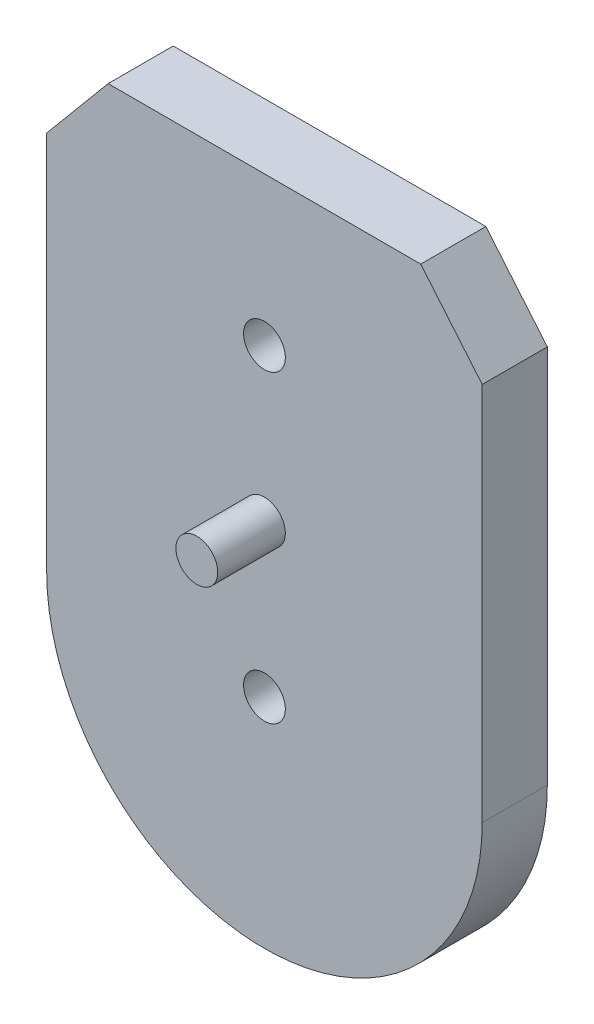
ISO-10303-21;
HEADER;
FILE_DESCRIPTION(('STEP AP214'),'2;1');
FILE_NAME('part.step','',(''),(''),'','','');
FILE_SCHEMA(('AUTOMOTIVE_DESIGN { 1 0 10303 214 1 1 1 1 }'));
ENDSEC;
DATA;
#1=APPLICATION_CONTEXT('core data for automotive mechanical design processes');
#2=APPLICATION_PROTOCOL_DEFINITION('international standard','automotive_design',2000,#1);
#3=PRODUCT_CONTEXT('',#1,'mechanical');
#4=PRODUCT('Part','Part','',(#3));
#5=PRODUCT_RELATED_PRODUCT_CATEGORY('part','',(#4));
#6=PRODUCT_DEFINITION_FORMATION('','',#4);
#7=PRODUCT_DEFINITION_CONTEXT('part definition',#1,'design');
#8=PRODUCT_DEFINITION('design','',#6,#7);
#9=PRODUCT_DEFINITION_SHAPE('','',#8);
#10=(LENGTH_UNIT() NAMED_UNIT(*) SI_UNIT(.MILLI.,.METRE.));
#11=(NAMED_UNIT(*) PLANE_ANGLE_UNIT() SI_UNIT($,.RADIAN.));
#12=(NAMED_UNIT(*) SI_UNIT($,.STERADIAN.) SOLID_ANGLE_UNIT());
#13=UNCERTAINTY_MEASURE_WITH_UNIT(LENGTH_MEASURE(1.E-05),#10,'distance_accuracy_value','');
#14=(GEOMETRIC_REPRESENTATION_CONTEXT(3) GLOBAL_UNCERTAINTY_ASSIGNED_CONTEXT((#13)) GLOBAL_UNIT_ASSIGNED_CONTEXT((#10,
#11,#12)) REPRESENTATION_CONTEXT('',''));
#15=CARTESIAN_POINT('',(0.,0.,0.));
#16=DIRECTION('',(0.,0.,1.));
#17=DIRECTION('',(1.,0.,0.));
#18=AXIS2_PLACEMENT_3D('',#15,#16,#17);
#19=CARTESIAN_POINT('',(-125.,0.,18.6875));
#20=DIRECTION('',(1.,0.,0.));
#21=DIRECTION('',(0.,0.,-1.));
#22=AXIS2_PLACEMENT_3D('',#19,#20,#21);
#23=PLANE('',#22);
#24=DIRECTION('',(0.,-1.,0.));
#25=VECTOR('',#24,1.);
#26=CARTESIAN_POINT('',(-125.,0.,-18.6875));
#27=LINE('',#26,#25);
#28=CARTESIAN_POINT('',(-125.,80.4995315023905,-18.6875));
#29=VERTEX_POINT('',#28);
#30=CARTESIAN_POINT('',(-125.,-137.375,-18.6875));
#31=VERTEX_POINT('',#30);
#32=EDGE_CURVE('E144',#29,#31,#27,.T.);
#33=ORIENTED_EDGE('',*,*,#32,.T.);
#34=DIRECTION('',(0.,0.,-1.));
#35=VECTOR('',#34,1.);
#36=CARTESIAN_POINT('',(-125.,-137.375,18.6875));
#37=LINE('',#36,#35);
#38=CARTESIAN_POINT('',(-125.,-137.375,18.6875));
#39=VERTEX_POINT('',#38);
#40=EDGE_CURVE('E11',#39,#31,#37,.T.);
#41=ORIENTED_EDGE('',*,*,#40,.F.);
#42=DIRECTION('',(0.,-1.,0.));
#43=VECTOR('',#42,1.);
#44=CARTESIAN_POINT('',(-125.,0.,18.6875));
#45=LINE('',#44,#43);
#46=CARTESIAN_POINT('',(-125.,80.4995315023905,18.6875));
#47=VERTEX_POINT('',#46);
#48=EDGE_CURVE('E172',#47,#39,#45,.T.);
#49=ORIENTED_EDGE('',*,*,#48,.F.);
#50=DIRECTION('',(0.,0.,-1.));
#51=VECTOR('',#50,1.);
#52=CARTESIAN_POINT('',(-125.,80.4995315023905,18.6875));
#53=LINE('',#52,#51);
#54=EDGE_CURVE('E63',#47,#29,#53,.T.);
#55=ORIENTED_EDGE('',*,*,#54,.T.);
#56=EDGE_LOOP('',(#33,#41,#49,#55));
#57=FACE_BOUND('',#56,.T.);
#58=ADVANCED_FACE('F45',(#57),#23,.F.);
#59=CARTESIAN_POINT('',(0.,-137.375,18.6875));
#60=DIRECTION('',(0.,0.,-1.));
#61=DIRECTION('',(-1.,0.,0.));
#62=AXIS2_PLACEMENT_3D('',#59,#60,#61);
#63=CYLINDRICAL_SURFACE('',#62,125.);
#64=CARTESIAN_POINT('',(0.,-137.375,-18.6875));
#65=DIRECTION('',(0.,0.,1.));
#66=DIRECTION('',(1.,0.,0.));
#67=AXIS2_PLACEMENT_3D('',#64,#65,#66);
#68=CIRCLE('',#67,125.);
#69=CARTESIAN_POINT('',(125.,-137.375,-18.6875));
#70=VERTEX_POINT('',#69);
#71=EDGE_CURVE('E147',#31,#70,#68,.T.);
#72=ORIENTED_EDGE('',*,*,#71,.T.);
#73=DIRECTION('',(0.,0.,-1.));
#74=VECTOR('',#73,1.);
#75=CARTESIAN_POINT('',(125.,-137.375,18.6875));
#76=LINE('',#75,#74);
#77=CARTESIAN_POINT('',(125.,-137.375,18.6875));
#78=VERTEX_POINT('',#77);
#79=EDGE_CURVE('E55',#78,#70,#76,.T.);
#80=ORIENTED_EDGE('',*,*,#79,.F.);
#81=CARTESIAN_POINT('',(0.,-137.375,18.6875));
#82=DIRECTION('',(0.,0.,1.));
#83=DIRECTION('',(1.,0.,0.));
#84=AXIS2_PLACEMENT_3D('',#81,#82,#83);
#85=CIRCLE('',#84,125.);
#86=EDGE_CURVE('E95',#39,#78,#85,.T.);
#87=ORIENTED_EDGE('',*,*,#86,.F.);
#88=ORIENTED_EDGE('',*,*,#40,.T.);
#89=EDGE_LOOP('',(#72,#80,#87,#88));
#90=FACE_BOUND('',#89,.T.);
#91=ADVANCED_FACE('F183',(#90),#63,.T.);
#92=CARTESIAN_POINT('',(125.,0.,18.6875));
#93=DIRECTION('',(1.,0.,0.));
#94=DIRECTION('',(0.,1.,0.));
#95=AXIS2_PLACEMENT_3D('',#92,#93,#94);
#96=PLANE('',#95);
#97=DIRECTION('',(0.,-1.,0.));
#98=VECTOR('',#97,1.);
#99=CARTESIAN_POINT('',(125.,0.,-18.6875));
#100=LINE('',#99,#98);
#101=CARTESIAN_POINT('',(125.,80.4995315023905,-18.6875));
#102=VERTEX_POINT('',#101);
#103=EDGE_CURVE('E151',#102,#70,#100,.T.);
#104=ORIENTED_EDGE('',*,*,#103,.F.);
#105=DIRECTION('',(0.,0.,-1.));
#106=VECTOR('',#105,1.);
#107=CARTESIAN_POINT('',(125.,80.4995315023905,18.6875));
#108=LINE('',#107,#106);
#109=CARTESIAN_POINT('',(125.,80.4995315023905,18.6875));
#110=VERTEX_POINT('',#109);
#111=EDGE_CURVE('E115',#110,#102,#108,.T.);
#112=ORIENTED_EDGE('',*,*,#111,.F.);
#113=DIRECTION('',(0.,-1.,0.));
#114=VECTOR('',#113,1.);
#115=CARTESIAN_POINT('',(125.,0.,18.6875));
#116=LINE('',#115,#114);
#117=EDGE_CURVE('E125',#110,#78,#116,.T.);
#118=ORIENTED_EDGE('',*,*,#117,.T.);
#119=ORIENTED_EDGE('',*,*,#79,.T.);
#120=EDGE_LOOP('',(#104,#112,#118,#119));
#121=FACE_BOUND('',#120,.T.);
#122=ADVANCED_FACE('F182',(#121),#96,.T.);
#123=CARTESIAN_POINT('',(113.198816728198,94.6181722515399,18.6875));
#124=DIRECTION('',(0.767267640083497,0.641327037072897,0.));
#125=DIRECTION('',(-0.641327037072897,0.767267640083497,0.));
#126=AXIS2_PLACEMENT_3D('',#123,#124,#125);
#127=PLANE('',#126);
#128=DIRECTION('',(0.641327037072897,-0.767267640083497,0.));
#129=VECTOR('',#128,1.);
#130=CARTESIAN_POINT('',(113.198816728198,94.6181722515399,-18.6875));
#131=LINE('',#130,#129);
#132=CARTESIAN_POINT('',(89.7236135529367,122.703318673826,-18.6875));
#133=VERTEX_POINT('',#132);
#134=EDGE_CURVE('E110',#133,#102,#131,.T.);
#135=ORIENTED_EDGE('',*,*,#134,.F.);
#136=DIRECTION('',(0.,0.,-1.));
#137=VECTOR('',#136,1.);
#138=CARTESIAN_POINT('',(89.7236135529367,122.703318673826,18.6875));
#139=LINE('',#138,#137);
#140=CARTESIAN_POINT('',(89.7236135529367,122.703318673826,18.6875));
#141=VERTEX_POINT('',#140);
#142=EDGE_CURVE('E105',#141,#133,#139,.T.);
#143=ORIENTED_EDGE('',*,*,#142,.F.);
#144=DIRECTION('',(0.641327037072897,-0.767267640083497,0.));
#145=VECTOR('',#144,1.);
#146=CARTESIAN_POINT('',(113.198816728198,94.6181722515399,18.6875));
#147=LINE('',#146,#145);
#148=EDGE_CURVE('E108',#141,#110,#147,.T.);
#149=ORIENTED_EDGE('',*,*,#148,.T.);
#150=ORIENTED_EDGE('',*,*,#111,.T.);
#151=EDGE_LOOP('',(#135,#143,#149,#150));
#152=FACE_BOUND('',#151,.T.);
#153=ADVANCED_FACE('F107',(#152),#127,.T.);
#154=CARTESIAN_POINT('',(0.,122.703318673826,18.6875));
#155=DIRECTION('',(0.,1.,0.));
#156=DIRECTION('',(-1.,0.,0.));
#157=AXIS2_PLACEMENT_3D('',#154,#155,#156);
#158=PLANE('',#157);
#159=DIRECTION('',(1.,0.,0.));
#160=VECTOR('',#159,1.);
#161=CARTESIAN_POINT('',(0.,122.703318673826,-18.6875));
#162=LINE('',#161,#160);
#163=CARTESIAN_POINT('',(-89.7236136799374,122.703318673826,-18.6875));
#164=VERTEX_POINT('',#163);
#165=EDGE_CURVE('E157',#164,#133,#162,.T.);
#166=ORIENTED_EDGE('',*,*,#165,.F.);
#167=DIRECTION('',(0.,0.,-1.));
#168=VECTOR('',#167,1.);
#169=CARTESIAN_POINT('',(-89.7236136799374,122.703318673826,18.6875));
#170=LINE('',#169,#168);
#171=CARTESIAN_POINT('',(-89.7236136799374,122.703318673826,18.6875));
#172=VERTEX_POINT('',#171);
#173=EDGE_CURVE('E83',#172,#164,#170,.T.);
#174=ORIENTED_EDGE('',*,*,#173,.F.);
#175=DIRECTION('',(1.,0.,0.));
#176=VECTOR('',#175,1.);
#177=CARTESIAN_POINT('',(0.,122.703318673826,18.6875));
#178=LINE('',#177,#176);
#179=EDGE_CURVE('E123',#172,#141,#178,.T.);
#180=ORIENTED_EDGE('',*,*,#179,.T.);
#181=ORIENTED_EDGE('',*,*,#142,.T.);
#182=EDGE_LOOP('',(#166,#174,#180,#181));
#183=FACE_BOUND('',#182,.T.);
#184=ADVANCED_FACE('F128',(#183),#158,.T.);
#185=CARTESIAN_POINT('',(0.,-137.375,18.6875));
#186=DIRECTION('',(0.,0.,-1.));
#187=DIRECTION('',(-1.,0.,0.));
#188=AXIS2_PLACEMENT_3D('',#185,#186,#187);
#189=CYLINDRICAL_SURFACE('',#188,12.);
#190=CARTESIAN_POINT('',(0.,-137.375,18.6875));
#191=DIRECTION('',(0.,0.,1.));
#192=DIRECTION('',(1.,0.,0.));
#193=AXIS2_PLACEMENT_3D('',#190,#191,#192);
#194=CIRCLE('',#193,12.);
#195=CARTESIAN_POINT('',(12.,-137.375,18.6875));
#196=VERTEX_POINT('',#195);
#197=EDGE_CURVE('E133',#196,#196,#194,.T.);
#198=ORIENTED_EDGE('',*,*,#197,.T.);
#199=EDGE_LOOP('',(#198));
#200=FACE_BOUND('',#199,.T.);
#201=CARTESIAN_POINT('',(0.,-137.375,-18.6875));
#202=DIRECTION('',(0.,0.,1.));
#203=DIRECTION('',(1.,0.,0.));
#204=AXIS2_PLACEMENT_3D('',#201,#202,#203);
#205=CIRCLE('',#204,12.);
#206=CARTESIAN_POINT('',(12.,-137.375,-18.6875));
#207=VERTEX_POINT('',#206);
#208=EDGE_CURVE('E164',#207,#207,#205,.T.);
#209=ORIENTED_EDGE('',*,*,#208,.F.);
#210=EDGE_LOOP('',(#209));
#211=FACE_BOUND('',#210,.T.);
#212=ADVANCED_FACE('F191',(#200,#211),#189,.F.);
#213=CARTESIAN_POINT('',(-113.198816920828,94.6181720719111,18.6875));
#214=DIRECTION('',(-0.767267641219627,0.64132703571366,0.));
#215=DIRECTION('',(-0.64132703571366,-0.767267641219627,0.));
#216=AXIS2_PLACEMENT_3D('',#213,#214,#215);
#217=PLANE('',#216);
#218=DIRECTION('',(0.64132703571366,0.767267641219627,0.));
#219=VECTOR('',#218,1.);
#220=CARTESIAN_POINT('',(-113.198816920828,94.6181720719111,-18.6875));
#221=LINE('',#220,#219);
#222=EDGE_CURVE('E160',#29,#164,#221,.T.);
#223=ORIENTED_EDGE('',*,*,#222,.F.);
#224=ORIENTED_EDGE('',*,*,#54,.F.);
#225=DIRECTION('',(0.64132703571366,0.767267641219627,0.));
#226=VECTOR('',#225,1.);
#227=CARTESIAN_POINT('',(-113.198816920828,94.6181720719111,18.6875));
#228=LINE('',#227,#226);
#229=EDGE_CURVE('E130',#47,#172,#228,.T.);
#230=ORIENTED_EDGE('',*,*,#229,.T.);
#231=ORIENTED_EDGE('',*,*,#173,.T.);
#232=EDGE_LOOP('',(#223,#224,#230,#231));
#233=FACE_BOUND('',#232,.T.);
#234=ADVANCED_FACE('F188',(#233),#217,.T.);
#235=CARTESIAN_POINT('',(0.,37.375,18.6875));
#236=DIRECTION('',(0.,0.,-1.));
#237=DIRECTION('',(-1.,0.,0.));
#238=AXIS2_PLACEMENT_3D('',#235,#236,#237);
#239=CYLINDRICAL_SURFACE('',#238,12.);
#240=CARTESIAN_POINT('',(0.,37.375,18.6875));
#241=DIRECTION('',(0.,0.,1.));
#242=DIRECTION('',(1.,0.,0.));
#243=AXIS2_PLACEMENT_3D('',#240,#241,#242);
#244=CIRCLE('',#243,12.);
#245=CARTESIAN_POINT('',(12.,37.375,18.6875));
#246=VERTEX_POINT('',#245);
#247=EDGE_CURVE('E140',#246,#246,#244,.T.);
#248=ORIENTED_EDGE('',*,*,#247,.T.);
#249=EDGE_LOOP('',(#248));
#250=FACE_BOUND('',#249,.T.);
#251=CARTESIAN_POINT('',(0.,37.375,-18.6875));
#252=DIRECTION('',(0.,0.,1.));
#253=DIRECTION('',(1.,0.,0.));
#254=AXIS2_PLACEMENT_3D('',#251,#252,#253);
#255=CIRCLE('',#254,12.);
#256=CARTESIAN_POINT('',(12.,37.375,-18.6875));
#257=VERTEX_POINT('',#256);
#258=EDGE_CURVE('E168',#257,#257,#255,.T.);
#259=ORIENTED_EDGE('',*,*,#258,.F.);
#260=EDGE_LOOP('',(#259));
#261=FACE_BOUND('',#260,.T.);
#262=ADVANCED_FACE('F190',(#250,#261),#239,.F.);
#263=CARTESIAN_POINT('',(0.,0.,18.6875));
#264=DIRECTION('',(0.,0.,1.));
#265=DIRECTION('',(1.,0.,0.));
#266=AXIS2_PLACEMENT_3D('',#263,#264,#265);
#267=PLANE('',#266);
#268=CARTESIAN_POINT('',(0.,-50.,18.6875));
#269=DIRECTION('',(0.,0.,1.));
#270=DIRECTION('',(1.,0.,0.));
#271=AXIS2_PLACEMENT_3D('',#268,#269,#270);
#272=CIRCLE('',#271,12.);
#273=CARTESIAN_POINT('',(12.,-50.,18.6875));
#274=VERTEX_POINT('',#273);
#275=EDGE_CURVE('E48',#274,#274,#272,.F.);
#276=ORIENTED_EDGE('',*,*,#275,.T.);
#277=EDGE_LOOP('',(#276));
#278=FACE_BOUND('',#277,.T.);
#279=ORIENTED_EDGE('',*,*,#48,.T.);
#280=ORIENTED_EDGE('',*,*,#86,.T.);
#281=ORIENTED_EDGE('',*,*,#117,.F.);
#282=ORIENTED_EDGE('',*,*,#148,.F.);
#283=ORIENTED_EDGE('',*,*,#179,.F.);
#284=ORIENTED_EDGE('',*,*,#229,.F.);
#285=EDGE_LOOP('',(#279,#280,#281,#282,#283,#284));
#286=FACE_BOUND('',#285,.T.);
#287=ORIENTED_EDGE('',*,*,#197,.F.);
#288=EDGE_LOOP('',(#287));
#289=FACE_BOUND('',#288,.T.);
#290=ORIENTED_EDGE('',*,*,#247,.F.);
#291=EDGE_LOOP('',(#290));
#292=FACE_BOUND('',#291,.T.);
#293=ADVANCED_FACE('F120',(#278,#286,#289,#292),#267,.T.);
#294=CARTESIAN_POINT('',(0.,0.,-18.6875));
#295=DIRECTION('',(0.,0.,1.));
#296=DIRECTION('',(1.,0.,0.));
#297=AXIS2_PLACEMENT_3D('',#294,#295,#296);
#298=PLANE('',#297);
#299=ORIENTED_EDGE('',*,*,#32,.F.);
#300=ORIENTED_EDGE('',*,*,#222,.T.);
#301=ORIENTED_EDGE('',*,*,#165,.T.);
#302=ORIENTED_EDGE('',*,*,#134,.T.);
#303=ORIENTED_EDGE('',*,*,#103,.T.);
#304=ORIENTED_EDGE('',*,*,#71,.F.);
#305=EDGE_LOOP('',(#299,#300,#301,#302,#303,#304));
#306=FACE_BOUND('',#305,.T.);
#307=ORIENTED_EDGE('',*,*,#208,.T.);
#308=EDGE_LOOP('',(#307));
#309=FACE_BOUND('',#308,.T.);
#310=ORIENTED_EDGE('',*,*,#258,.T.);
#311=EDGE_LOOP('',(#310));
#312=FACE_BOUND('',#311,.T.);
#313=ADVANCED_FACE('F186',(#306,#309,#312),#298,.F.);
#314=CARTESIAN_POINT('',(0.,-50.,57.5));
#315=DIRECTION('',(0.,0.,-1.));
#316=DIRECTION('',(-1.,0.,0.));
#317=AXIS2_PLACEMENT_3D('',#314,#315,#316);
#318=CYLINDRICAL_SURFACE('',#317,12.);
#319=ORIENTED_EDGE('',*,*,#275,.F.);
#320=EDGE_LOOP('',(#319));
#321=FACE_BOUND('',#320,.T.);
#322=CARTESIAN_POINT('',(0.,-50.,57.5));
#323=DIRECTION('',(0.,0.,1.));
#324=DIRECTION('',(1.,0.,0.));
#325=AXIS2_PLACEMENT_3D('',#322,#323,#324);
#326=CIRCLE('',#325,12.);
#327=CARTESIAN_POINT('',(12.,-50.,57.5));
#328=VERTEX_POINT('',#327);
#329=EDGE_CURVE('E211',#328,#328,#326,.T.);
#330=ORIENTED_EDGE('',*,*,#329,.F.);
#331=EDGE_LOOP('',(#330));
#332=FACE_BOUND('',#331,.T.);
#333=ADVANCED_FACE('F222',(#321,#332),#318,.T.);
#334=CARTESIAN_POINT('',(0.,-50.,57.5));
#335=DIRECTION('',(0.,0.,1.));
#336=DIRECTION('',(1.,0.,0.));
#337=AXIS2_PLACEMENT_3D('',#334,#335,#336);
#338=PLANE('',#337);
#339=ORIENTED_EDGE('',*,*,#329,.T.);
#340=EDGE_LOOP('',(#339));
#341=FACE_BOUND('',#340,.T.);
#342=ADVANCED_FACE('F225',(#341),#338,.T.);
#343=CLOSED_SHELL('',(#58,#91,#122,#153,#184,#212,#234,#262,#293,#313,#333,#342));
#344=MANIFOLD_SOLID_BREP('B2',#343);
#345=ADVANCED_BREP_SHAPE_REPRESENTATION('',(#18,#344),#14);
#346=SHAPE_DEFINITION_REPRESENTATION(#9,#345);
ENDSEC;
END-ISO-10303-21;
